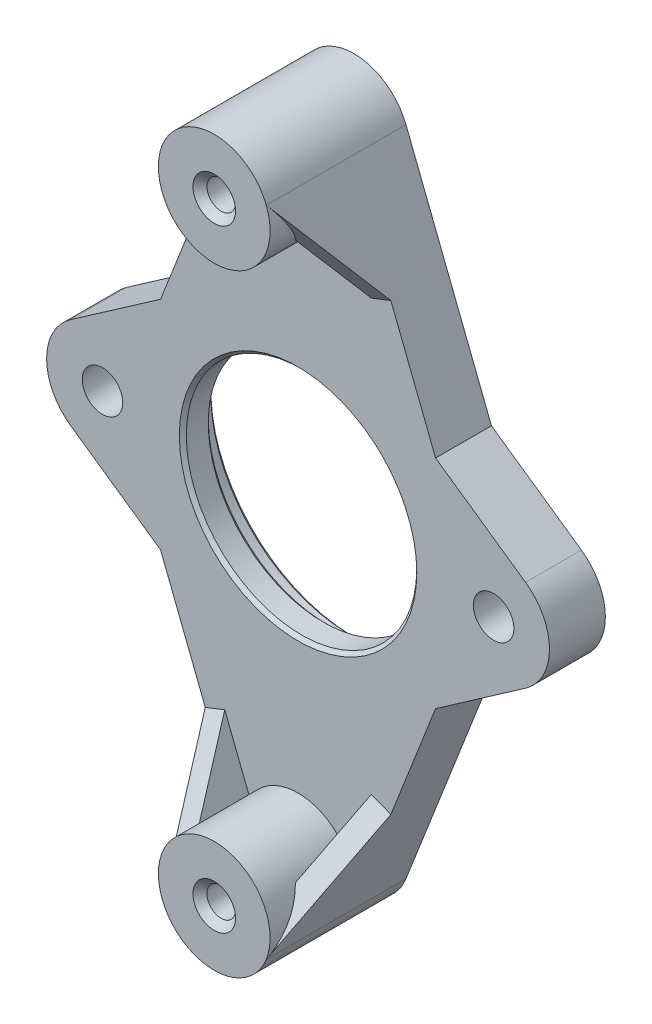
ISO-10303-21;
HEADER;
FILE_DESCRIPTION(('STEP AP214'),'2;1');
FILE_NAME('part.step','',(''),(''),'','','');
FILE_SCHEMA(('AUTOMOTIVE_DESIGN { 1 0 10303 214 1 1 1 1 }'));
ENDSEC;
DATA;
#1=APPLICATION_CONTEXT('core data for automotive mechanical design processes');
#2=APPLICATION_PROTOCOL_DEFINITION('international standard','automotive_design',2000,#1);
#3=PRODUCT_CONTEXT('',#1,'mechanical');
#4=PRODUCT('Part','Part','',(#3));
#5=PRODUCT_RELATED_PRODUCT_CATEGORY('part','',(#4));
#6=PRODUCT_DEFINITION_FORMATION('','',#4);
#7=PRODUCT_DEFINITION_CONTEXT('part definition',#1,'design');
#8=PRODUCT_DEFINITION('design','',#6,#7);
#9=PRODUCT_DEFINITION_SHAPE('','',#8);
#10=(LENGTH_UNIT() NAMED_UNIT(*) SI_UNIT(.MILLI.,.METRE.));
#11=(NAMED_UNIT(*) PLANE_ANGLE_UNIT() SI_UNIT($,.RADIAN.));
#12=(NAMED_UNIT(*) SI_UNIT($,.STERADIAN.) SOLID_ANGLE_UNIT());
#13=UNCERTAINTY_MEASURE_WITH_UNIT(LENGTH_MEASURE(1.E-05),#10,'distance_accuracy_value','');
#14=(GEOMETRIC_REPRESENTATION_CONTEXT(3) GLOBAL_UNCERTAINTY_ASSIGNED_CONTEXT((#13)) GLOBAL_UNIT_ASSIGNED_CONTEXT((#10,
#11,#12)) REPRESENTATION_CONTEXT('',''));
#15=CARTESIAN_POINT('',(0.,0.,0.));
#16=DIRECTION('',(0.,0.,1.));
#17=DIRECTION('',(1.,0.,0.));
#18=AXIS2_PLACEMENT_3D('',#15,#16,#17);
#19=CARTESIAN_POINT('',(0.,21.92,35.036562512032));
#20=DIRECTION('',(0.,0.,-1.));
#21=DIRECTION('',(-1.,0.,0.));
#22=AXIS2_PLACEMENT_3D('',#19,#20,#21);
#23=CYLINDRICAL_SURFACE('',#22,4.);
#24=CARTESIAN_POINT('',(0.,21.92,4.));
#25=DIRECTION('',(0.,0.,1.));
#26=DIRECTION('',(1.,0.,0.));
#27=AXIS2_PLACEMENT_3D('',#24,#25,#26);
#28=CIRCLE('',#27,4.);
#29=CARTESIAN_POINT('',(3.46715274058221,19.9252940383422,4.));
#30=VERTEX_POINT('',#29);
#31=CARTESIAN_POINT('',(-3.46715274058221,19.9252940383422,4.));
#32=VERTEX_POINT('',#31);
#33=EDGE_CURVE('E302',#30,#32,#28,.F.);
#34=ORIENTED_EDGE('',*,*,#33,.F.);
#35=DIRECTION('',(0.,0.,-1.));
#36=VECTOR('',#35,1.);
#37=CARTESIAN_POINT('',(3.46715274058221,19.9252940383422,35.036562512032));
#38=LINE('',#37,#36);
#39=CARTESIAN_POINT('',(3.46715274058221,19.9252940383422,7.6581257506006));
#40=VERTEX_POINT('',#39);
#41=EDGE_CURVE('E227',#30,#40,#38,.F.);
#42=ORIENTED_EDGE('',*,*,#41,.T.);
#43=CARTESIAN_POINT('',(0.,21.92,10.));
#44=DIRECTION('',(0.218978102189781,-0.558613095766079,0.8));
#45=DIRECTION('',(0.291970802919708,-0.744817461021437,-0.6));
#46=AXIS2_PLACEMENT_3D('',#43,#44,#45);
#47=ELLIPSE('',#46,5.,4.);
#48=CARTESIAN_POINT('',(3.72408730510719,23.3798540145985,10.));
#49=VERTEX_POINT('',#48);
#50=EDGE_CURVE('E219',#40,#49,#47,.T.);
#51=ORIENTED_EDGE('',*,*,#50,.T.);
#52=CARTESIAN_POINT('',(0.,21.92,10.));
#53=DIRECTION('',(0.,0.,1.));
#54=DIRECTION('',(1.,0.,0.));
#55=AXIS2_PLACEMENT_3D('',#52,#53,#54);
#56=CIRCLE('',#55,4.);
#57=CARTESIAN_POINT('',(-3.72408730510719,23.3798540145985,10.));
#58=VERTEX_POINT('',#57);
#59=EDGE_CURVE('E292',#58,#49,#56,.T.);
#60=ORIENTED_EDGE('',*,*,#59,.F.);
#61=CARTESIAN_POINT('',(0.,21.92,10.));
#62=DIRECTION('',(0.218978102189781,0.558613095766079,-0.8));
#63=DIRECTION('',(-0.291970802919708,-0.744817461021437,-0.6));
#64=AXIS2_PLACEMENT_3D('',#61,#62,#63);
#65=ELLIPSE('',#64,5.,4.);
#66=CARTESIAN_POINT('',(-3.46715274058221,19.9252940383422,7.6581257506006));
#67=VERTEX_POINT('',#66);
#68=EDGE_CURVE('E250',#67,#58,#65,.T.);
#69=ORIENTED_EDGE('',*,*,#68,.F.);
#70=DIRECTION('',(0.,0.,-1.));
#71=VECTOR('',#70,1.);
#72=CARTESIAN_POINT('',(-3.46715274058221,19.9252940383422,35.036562512032));
#73=LINE('',#72,#71);
#74=EDGE_CURVE('E247',#67,#32,#73,.T.);
#75=ORIENTED_EDGE('',*,*,#74,.T.);
#76=EDGE_LOOP('',(#34,#42,#51,#60,#69,#75));
#77=FACE_BOUND('',#76,.T.);
#78=ADVANCED_FACE('F75',(#77),#23,.T.);
#79=CARTESIAN_POINT('',(0.,0.,4.));
#80=DIRECTION('',(0.,0.,1.));
#81=DIRECTION('',(1.,0.,0.));
#82=AXIS2_PLACEMENT_3D('',#79,#80,#81);
#83=PLANE('',#82);
#84=DIRECTION('',(0.931021826276797,0.364963503649635,0.));
#85=VECTOR('',#84,1.);
#86=CARTESIAN_POINT('',(5.24726259488907,15.3842341489097,4.));
#87=LINE('',#86,#85);
#88=CARTESIAN_POINT('',(5.24726259488907,15.3842341489097,4.));
#89=VERTEX_POINT('',#88);
#90=CARTESIAN_POINT('',(6.64379533430427,15.9316794043842,4.));
#91=VERTEX_POINT('',#90);
#92=EDGE_CURVE('E216',#89,#91,#87,.T.);
#93=ORIENTED_EDGE('',*,*,#92,.F.);
#94=DIRECTION('',(-0.364963503649635,0.931021826276797,0.));
#95=VECTOR('',#94,1.);
#96=CARTESIAN_POINT('',(5.24726259488907,15.3842341489097,4.));
#97=LINE('',#96,#95);
#98=EDGE_CURVE('E222',#89,#30,#97,.T.);
#99=ORIENTED_EDGE('',*,*,#98,.T.);
#100=ORIENTED_EDGE('',*,*,#33,.T.);
#101=DIRECTION('',(0.364963503649635,0.931021826276797,0.));
#102=VECTOR('',#101,1.);
#103=CARTESIAN_POINT('',(-5.24726259488907,15.3842341489097,4.));
#104=LINE('',#103,#102);
#105=CARTESIAN_POINT('',(-5.24726259488907,15.3842341489097,4.));
#106=VERTEX_POINT('',#105);
#107=EDGE_CURVE('E91',#106,#32,#104,.T.);
#108=ORIENTED_EDGE('',*,*,#107,.F.);
#109=DIRECTION('',(-0.931021826276797,0.364963503649635,0.));
#110=VECTOR('',#109,1.);
#111=CARTESIAN_POINT('',(-5.24726259488907,15.3842341489097,4.));
#112=LINE('',#111,#110);
#113=CARTESIAN_POINT('',(-6.64379533430427,15.9316794043842,4.));
#114=VERTEX_POINT('',#113);
#115=EDGE_CURVE('E96',#106,#114,#112,.T.);
#116=ORIENTED_EDGE('',*,*,#115,.T.);
#117=DIRECTION('',(-0.364963503649635,-0.931021826276797,0.));
#118=VECTOR('',#117,1.);
#119=CARTESIAN_POINT('',(-11.1722619153216,4.37956204379562,4.));
#120=LINE('',#119,#118);
#121=CARTESIAN_POINT('',(-9.84395503832748,7.7680726266573,4.));
#122=VERTEX_POINT('',#121);
#123=EDGE_CURVE('E308',#114,#122,#120,.T.);
#124=ORIENTED_EDGE('',*,*,#123,.T.);
#125=DIRECTION('',(-0.82065180664829,-0.571428571428572,0.));
#126=VECTOR('',#125,1.);
#127=CARTESIAN_POINT('',(-6.85714285714286,9.84782167977948,4.));
#128=LINE('',#127,#126);
#129=CARTESIAN_POINT('',(-16.2857142857143,3.28260722659316,4.));
#130=VERTEX_POINT('',#129);
#131=EDGE_CURVE('E356',#122,#130,#128,.T.);
#132=ORIENTED_EDGE('',*,*,#131,.T.);
#133=CARTESIAN_POINT('',(-14.,0.,4.));
#134=DIRECTION('',(0.,0.,1.));
#135=DIRECTION('',(1.,0.,0.));
#136=AXIS2_PLACEMENT_3D('',#133,#134,#135);
#137=CIRCLE('',#136,4.);
#138=CARTESIAN_POINT('',(-16.2857142857143,-3.28260722659316,4.));
#139=VERTEX_POINT('',#138);
#140=EDGE_CURVE('E358',#130,#139,#137,.T.);
#141=ORIENTED_EDGE('',*,*,#140,.T.);
#142=DIRECTION('',(-0.82065180664829,0.571428571428572,0.));
#143=VECTOR('',#142,1.);
#144=CARTESIAN_POINT('',(-6.85714285714286,-9.84782167977948,4.));
#145=LINE('',#144,#143);
#146=CARTESIAN_POINT('',(-9.84395503832748,-7.7680726266573,4.));
#147=VERTEX_POINT('',#146);
#148=EDGE_CURVE('E362',#147,#139,#145,.T.);
#149=ORIENTED_EDGE('',*,*,#148,.F.);
#150=DIRECTION('',(-0.364963503649635,0.931021826276797,0.));
#151=VECTOR('',#150,1.);
#152=CARTESIAN_POINT('',(-11.1722619153216,-4.37956204379562,4.));
#153=LINE('',#152,#151);
#154=CARTESIAN_POINT('',(-6.64379533430427,-15.9316794043842,4.));
#155=VERTEX_POINT('',#154);
#156=EDGE_CURVE('E320',#155,#147,#153,.T.);
#157=ORIENTED_EDGE('',*,*,#156,.F.);
#158=DIRECTION('',(-0.931021826276797,-0.364963503649635,0.));
#159=VECTOR('',#158,1.);
#160=CARTESIAN_POINT('',(-5.24726259488907,-15.3842341489097,4.));
#161=LINE('',#160,#159);
#162=CARTESIAN_POINT('',(-5.24726259488907,-15.3842341489097,4.));
#163=VERTEX_POINT('',#162);
#164=EDGE_CURVE('E275',#163,#155,#161,.T.);
#165=ORIENTED_EDGE('',*,*,#164,.F.);
#166=DIRECTION('',(0.364963503649635,-0.931021826276797,0.));
#167=VECTOR('',#166,1.);
#168=CARTESIAN_POINT('',(-5.24726259488907,-15.3842341489097,4.));
#169=LINE('',#168,#167);
#170=CARTESIAN_POINT('',(-3.46715274058221,-19.9252940383422,4.));
#171=VERTEX_POINT('',#170);
#172=EDGE_CURVE('E272',#163,#171,#169,.T.);
#173=ORIENTED_EDGE('',*,*,#172,.T.);
#174=CARTESIAN_POINT('',(0.,-21.92,4.));
#175=DIRECTION('',(0.,0.,1.));
#176=DIRECTION('',(1.,0.,0.));
#177=AXIS2_PLACEMENT_3D('',#174,#175,#176);
#178=CIRCLE('',#177,4.);
#179=CARTESIAN_POINT('',(3.46715274058221,-19.9252940383422,4.));
#180=VERTEX_POINT('',#179);
#181=EDGE_CURVE('E295',#171,#180,#178,.F.);
#182=ORIENTED_EDGE('',*,*,#181,.T.);
#183=DIRECTION('',(-0.364963503649635,-0.931021826276797,0.));
#184=VECTOR('',#183,1.);
#185=CARTESIAN_POINT('',(5.24726259488907,-15.3842341489097,4.));
#186=LINE('',#185,#184);
#187=CARTESIAN_POINT('',(5.24726259488907,-15.3842341489097,4.));
#188=VERTEX_POINT('',#187);
#189=EDGE_CURVE('E254',#188,#180,#186,.T.);
#190=ORIENTED_EDGE('',*,*,#189,.F.);
#191=DIRECTION('',(0.931021826276797,-0.364963503649635,0.));
#192=VECTOR('',#191,1.);
#193=CARTESIAN_POINT('',(5.24726259488907,-15.3842341489097,4.));
#194=LINE('',#193,#192);
#195=CARTESIAN_POINT('',(6.64379533430427,-15.9316794043842,4.));
#196=VERTEX_POINT('',#195);
#197=EDGE_CURVE('E260',#188,#196,#194,.T.);
#198=ORIENTED_EDGE('',*,*,#197,.T.);
#199=DIRECTION('',(0.364963503649635,0.931021826276797,0.));
#200=VECTOR('',#199,1.);
#201=CARTESIAN_POINT('',(11.1722619153216,-4.37956204379562,4.));
#202=LINE('',#201,#200);
#203=CARTESIAN_POINT('',(9.84395503832748,-7.7680726266573,4.));
#204=VERTEX_POINT('',#203);
#205=EDGE_CURVE('E304',#196,#204,#202,.T.);
#206=ORIENTED_EDGE('',*,*,#205,.T.);
#207=DIRECTION('',(0.820651806648289,0.571428571428572,0.));
#208=VECTOR('',#207,1.);
#209=CARTESIAN_POINT('',(6.85714285714287,-9.84782167977947,4.));
#210=LINE('',#209,#208);
#211=CARTESIAN_POINT('',(16.2857142857143,-3.28260722659315,4.));
#212=VERTEX_POINT('',#211);
#213=EDGE_CURVE('E378',#204,#212,#210,.T.);
#214=ORIENTED_EDGE('',*,*,#213,.T.);
#215=CARTESIAN_POINT('',(14.,0.,4.));
#216=DIRECTION('',(0.,0.,1.));
#217=DIRECTION('',(1.,0.,0.));
#218=AXIS2_PLACEMENT_3D('',#215,#216,#217);
#219=CIRCLE('',#218,4.);
#220=CARTESIAN_POINT('',(16.2857142857143,3.28260722659316,4.));
#221=VERTEX_POINT('',#220);
#222=EDGE_CURVE('E380',#212,#221,#219,.T.);
#223=ORIENTED_EDGE('',*,*,#222,.T.);
#224=DIRECTION('',(0.82065180664829,-0.571428571428571,0.));
#225=VECTOR('',#224,1.);
#226=CARTESIAN_POINT('',(6.85714285714286,9.84782167977948,4.));
#227=LINE('',#226,#225);
#228=CARTESIAN_POINT('',(9.84395503832748,7.7680726266573,4.));
#229=VERTEX_POINT('',#228);
#230=EDGE_CURVE('E384',#229,#221,#227,.T.);
#231=ORIENTED_EDGE('',*,*,#230,.F.);
#232=DIRECTION('',(0.364963503649635,-0.931021826276797,0.));
#233=VECTOR('',#232,1.);
#234=CARTESIAN_POINT('',(11.1722619153216,4.37956204379563,4.));
#235=LINE('',#234,#233);
#236=EDGE_CURVE('E234',#91,#229,#235,.T.);
#237=ORIENTED_EDGE('',*,*,#236,.F.);
#238=EDGE_LOOP('',(#93,#99,#100,#108,#116,#124,#132,#141,#149,#157,#165,#173,#182,#190,#198,
#206,#214,#223,#231,#237));
#239=FACE_BOUND('',#238,.T.);
#240=CARTESIAN_POINT('',(0.,0.,4.));
#241=DIRECTION('',(0.,0.,1.));
#242=DIRECTION('',(1.,0.,0.));
#243=AXIS2_PLACEMENT_3D('',#240,#241,#242);
#244=CIRCLE('',#243,8.50000000000002);
#245=CARTESIAN_POINT('',(8.50000000000002,0.,4.));
#246=VERTEX_POINT('',#245);
#247=EDGE_CURVE('E401',#246,#246,#244,.F.);
#248=ORIENTED_EDGE('',*,*,#247,.T.);
#249=EDGE_LOOP('',(#248));
#250=FACE_BOUND('',#249,.T.);
#251=CARTESIAN_POINT('',(-14.,0.,4.));
#252=DIRECTION('',(0.,0.,1.));
#253=DIRECTION('',(1.,0.,0.));
#254=AXIS2_PLACEMENT_3D('',#251,#252,#253);
#255=CIRCLE('',#254,1.45);
#256=CARTESIAN_POINT('',(-12.55,0.,4.));
#257=VERTEX_POINT('',#256);
#258=EDGE_CURVE('E343',#257,#257,#255,.T.);
#259=ORIENTED_EDGE('',*,*,#258,.F.);
#260=EDGE_LOOP('',(#259));
#261=FACE_BOUND('',#260,.T.);
#262=CARTESIAN_POINT('',(14.,0.,4.));
#263=DIRECTION('',(0.,0.,1.));
#264=DIRECTION('',(1.,0.,0.));
#265=AXIS2_PLACEMENT_3D('',#262,#263,#264);
#266=CIRCLE('',#265,1.45);
#267=CARTESIAN_POINT('',(15.45,0.,4.));
#268=VERTEX_POINT('',#267);
#269=EDGE_CURVE('E349',#268,#268,#266,.T.);
#270=ORIENTED_EDGE('',*,*,#269,.F.);
#271=EDGE_LOOP('',(#270));
#272=FACE_BOUND('',#271,.T.);
#273=ADVANCED_FACE('F231',(#239,#250,#261,#272),#83,.T.);
#274=CARTESIAN_POINT('',(0.,-21.92,35.036562512032));
#275=DIRECTION('',(0.,0.,-1.));
#276=DIRECTION('',(-1.,0.,0.));
#277=AXIS2_PLACEMENT_3D('',#274,#275,#276);
#278=CYLINDRICAL_SURFACE('',#277,4.);
#279=DIRECTION('',(0.,0.,-1.));
#280=VECTOR('',#279,1.);
#281=CARTESIAN_POINT('',(3.72408730510719,-23.3798540145985,35.036562512032));
#282=LINE('',#281,#280);
#283=CARTESIAN_POINT('',(3.72408730510719,-23.3798540145985,10.));
#284=VERTEX_POINT('',#283);
#285=CARTESIAN_POINT('',(3.72408730510719,-23.3798540145985,0.));
#286=VERTEX_POINT('',#285);
#287=EDGE_CURVE('E327',#284,#286,#282,.T.);
#288=ORIENTED_EDGE('',*,*,#287,.F.);
#289=CARTESIAN_POINT('',(0.,-21.92,10.));
#290=DIRECTION('',(0.,0.,1.));
#291=DIRECTION('',(1.,0.,0.));
#292=AXIS2_PLACEMENT_3D('',#289,#290,#291);
#293=CIRCLE('',#292,4.);
#294=CARTESIAN_POINT('',(-3.72408730510719,-23.3798540145985,10.));
#295=VERTEX_POINT('',#294);
#296=EDGE_CURVE('E297',#295,#284,#293,.T.);
#297=ORIENTED_EDGE('',*,*,#296,.F.);
#298=DIRECTION('',(0.,0.,-1.));
#299=VECTOR('',#298,1.);
#300=CARTESIAN_POINT('',(-3.72408730510719,-23.3798540145985,35.036562512032));
#301=LINE('',#300,#299);
#302=CARTESIAN_POINT('',(-3.72408730510719,-23.3798540145985,0.));
#303=VERTEX_POINT('',#302);
#304=EDGE_CURVE('E326',#295,#303,#301,.T.);
#305=ORIENTED_EDGE('',*,*,#304,.T.);
#306=CARTESIAN_POINT('',(0.,-21.92,0.));
#307=DIRECTION('',(0.,0.,1.));
#308=DIRECTION('',(1.,0.,0.));
#309=AXIS2_PLACEMENT_3D('',#306,#307,#308);
#310=CIRCLE('',#309,4.);
#311=EDGE_CURVE('E328',#303,#286,#310,.T.);
#312=ORIENTED_EDGE('',*,*,#311,.T.);
#313=EDGE_LOOP('',(#288,#297,#305,#312));
#314=FACE_BOUND('',#313,.T.);
#315=ADVANCED_FACE('F452',(#314),#278,.T.);
#316=CARTESIAN_POINT('',(-6.85714285714286,9.84782167977948,4.));
#317=DIRECTION('',(0.571428571428572,-0.82065180664829,0.));
#318=DIRECTION('',(0.82065180664829,0.571428571428572,0.));
#319=AXIS2_PLACEMENT_3D('',#316,#317,#318);
#320=PLANE('',#319);
#321=DIRECTION('',(0.,0.,1.));
#322=VECTOR('',#321,1.);
#323=CARTESIAN_POINT('',(-9.84395503832748,7.7680726266573,4.));
#324=LINE('',#323,#322);
#325=CARTESIAN_POINT('',(-9.84395503832748,7.7680726266573,0.));
#326=VERTEX_POINT('',#325);
#327=EDGE_CURVE('E340',#326,#122,#324,.T.);
#328=ORIENTED_EDGE('',*,*,#327,.F.);
#329=DIRECTION('',(-0.82065180664829,-0.571428571428572,0.));
#330=VECTOR('',#329,1.);
#331=CARTESIAN_POINT('',(-6.85714285714286,9.84782167977948,0.));
#332=LINE('',#331,#330);
#333=CARTESIAN_POINT('',(-16.2857142857143,3.28260722659316,0.));
#334=VERTEX_POINT('',#333);
#335=EDGE_CURVE('E365',#326,#334,#332,.T.);
#336=ORIENTED_EDGE('',*,*,#335,.T.);
#337=DIRECTION('',(0.,0.,-1.));
#338=VECTOR('',#337,1.);
#339=CARTESIAN_POINT('',(-16.2857142857143,3.28260722659316,4.));
#340=LINE('',#339,#338);
#341=EDGE_CURVE('E374',#130,#334,#340,.T.);
#342=ORIENTED_EDGE('',*,*,#341,.F.);
#343=ORIENTED_EDGE('',*,*,#131,.F.);
#344=EDGE_LOOP('',(#328,#336,#342,#343));
#345=FACE_BOUND('',#344,.T.);
#346=ADVANCED_FACE('F488',(#345),#320,.F.);
#347=CARTESIAN_POINT('',(6.85714285714287,-9.84782167977947,4.));
#348=DIRECTION('',(-0.571428571428572,0.820651806648289,0.));
#349=DIRECTION('',(-0.820651806648289,-0.571428571428572,0.));
#350=AXIS2_PLACEMENT_3D('',#347,#348,#349);
#351=PLANE('',#350);
#352=DIRECTION('',(0.,0.,1.));
#353=VECTOR('',#352,1.);
#354=CARTESIAN_POINT('',(9.84395503832748,-7.7680726266573,4.));
#355=LINE('',#354,#353);
#356=CARTESIAN_POINT('',(9.84395503832748,-7.7680726266573,0.));
#357=VERTEX_POINT('',#356);
#358=EDGE_CURVE('E419',#357,#204,#355,.T.);
#359=ORIENTED_EDGE('',*,*,#358,.F.);
#360=DIRECTION('',(0.820651806648289,0.571428571428572,0.));
#361=VECTOR('',#360,1.);
#362=CARTESIAN_POINT('',(6.85714285714287,-9.84782167977947,0.));
#363=LINE('',#362,#361);
#364=CARTESIAN_POINT('',(16.2857142857143,-3.28260722659315,0.));
#365=VERTEX_POINT('',#364);
#366=EDGE_CURVE('E355',#357,#365,#363,.T.);
#367=ORIENTED_EDGE('',*,*,#366,.T.);
#368=DIRECTION('',(0.,0.,-1.));
#369=VECTOR('',#368,1.);
#370=CARTESIAN_POINT('',(16.2857142857143,-3.28260722659315,4.));
#371=LINE('',#370,#369);
#372=EDGE_CURVE('E368',#212,#365,#371,.T.);
#373=ORIENTED_EDGE('',*,*,#372,.F.);
#374=ORIENTED_EDGE('',*,*,#213,.F.);
#375=EDGE_LOOP('',(#359,#367,#373,#374));
#376=FACE_BOUND('',#375,.T.);
#377=ADVANCED_FACE('F533',(#376),#351,.F.);
#378=CARTESIAN_POINT('',(-14.,0.,4.));
#379=DIRECTION('',(0.,0.,-1.));
#380=DIRECTION('',(-1.,0.,0.));
#381=AXIS2_PLACEMENT_3D('',#378,#379,#380);
#382=CYLINDRICAL_SURFACE('',#381,4.);
#383=CARTESIAN_POINT('',(-14.,0.,0.));
#384=DIRECTION('',(0.,0.,1.));
#385=DIRECTION('',(1.,0.,0.));
#386=AXIS2_PLACEMENT_3D('',#383,#384,#385);
#387=CIRCLE('',#386,4.);
#388=CARTESIAN_POINT('',(-16.2857142857143,-3.28260722659316,0.));
#389=VERTEX_POINT('',#388);
#390=EDGE_CURVE('E367',#334,#389,#387,.T.);
#391=ORIENTED_EDGE('',*,*,#390,.T.);
#392=DIRECTION('',(0.,0.,-1.));
#393=VECTOR('',#392,1.);
#394=CARTESIAN_POINT('',(-16.2857142857143,-3.28260722659316,4.));
#395=LINE('',#394,#393);
#396=EDGE_CURVE('E364',#139,#389,#395,.T.);
#397=ORIENTED_EDGE('',*,*,#396,.F.);
#398=ORIENTED_EDGE('',*,*,#140,.F.);
#399=ORIENTED_EDGE('',*,*,#341,.T.);
#400=EDGE_LOOP('',(#391,#397,#398,#399));
#401=FACE_BOUND('',#400,.T.);
#402=ADVANCED_FACE('F492',(#401),#382,.T.);
#403=CARTESIAN_POINT('',(-6.85714285714286,-9.84782167977948,4.));
#404=DIRECTION('',(-0.571428571428572,-0.82065180664829,0.));
#405=DIRECTION('',(0.82065180664829,-0.571428571428572,0.));
#406=AXIS2_PLACEMENT_3D('',#403,#404,#405);
#407=PLANE('',#406);
#408=DIRECTION('',(0.,0.,-1.));
#409=VECTOR('',#408,1.);
#410=CARTESIAN_POINT('',(-9.84395503832748,-7.76807262665731,4.));
#411=LINE('',#410,#409);
#412=CARTESIAN_POINT('',(-9.84395503832748,-7.7680726266573,0.));
#413=VERTEX_POINT('',#412);
#414=EDGE_CURVE('E317',#147,#413,#411,.T.);
#415=ORIENTED_EDGE('',*,*,#414,.F.);
#416=ORIENTED_EDGE('',*,*,#148,.T.);
#417=ORIENTED_EDGE('',*,*,#396,.T.);
#418=DIRECTION('',(-0.82065180664829,0.571428571428572,0.));
#419=VECTOR('',#418,1.);
#420=CARTESIAN_POINT('',(-6.85714285714286,-9.84782167977948,0.));
#421=LINE('',#420,#419);
#422=EDGE_CURVE('E359',#413,#389,#421,.T.);
#423=ORIENTED_EDGE('',*,*,#422,.F.);
#424=EDGE_LOOP('',(#415,#416,#417,#423));
#425=FACE_BOUND('',#424,.T.);
#426=ADVANCED_FACE('F499',(#425),#407,.T.);
#427=CARTESIAN_POINT('',(0.,0.,0.));
#428=DIRECTION('',(0.,0.,1.));
#429=DIRECTION('',(1.,0.,0.));
#430=AXIS2_PLACEMENT_3D('',#427,#428,#429);
#431=PLANE('',#430);
#432=CARTESIAN_POINT('',(0.,21.92,0.));
#433=DIRECTION('',(0.,0.,1.));
#434=DIRECTION('',(1.,0.,0.));
#435=AXIS2_PLACEMENT_3D('',#432,#433,#434);
#436=CIRCLE('',#435,1.025);
#437=CARTESIAN_POINT('',(1.025,21.92,0.));
#438=VERTEX_POINT('',#437);
#439=EDGE_CURVE('E285',#438,#438,#436,.T.);
#440=ORIENTED_EDGE('',*,*,#439,.T.);
#441=EDGE_LOOP('',(#440));
#442=FACE_BOUND('',#441,.T.);
#443=CARTESIAN_POINT('',(0.,-21.92,0.));
#444=DIRECTION('',(0.,0.,1.));
#445=DIRECTION('',(1.,0.,0.));
#446=AXIS2_PLACEMENT_3D('',#443,#444,#445);
#447=CIRCLE('',#446,1.025);
#448=CARTESIAN_POINT('',(1.025,-21.92,0.));
#449=VERTEX_POINT('',#448);
#450=EDGE_CURVE('E288',#449,#449,#447,.T.);
#451=ORIENTED_EDGE('',*,*,#450,.T.);
#452=EDGE_LOOP('',(#451));
#453=FACE_BOUND('',#452,.T.);
#454=DIRECTION('',(-0.364963503649635,-0.931021826276797,0.));
#455=VECTOR('',#454,1.);
#456=CARTESIAN_POINT('',(-11.1722619153216,4.37956204379562,0.));
#457=LINE('',#456,#455);
#458=CARTESIAN_POINT('',(-3.72408730510719,23.3798540145985,0.));
#459=VERTEX_POINT('',#458);
#460=EDGE_CURVE('E309',#459,#326,#457,.T.);
#461=ORIENTED_EDGE('',*,*,#460,.F.);
#462=CARTESIAN_POINT('',(0.,21.92,0.));
#463=DIRECTION('',(0.,0.,1.));
#464=DIRECTION('',(1.,0.,0.));
#465=AXIS2_PLACEMENT_3D('',#462,#463,#464);
#466=CIRCLE('',#465,4.);
#467=CARTESIAN_POINT('',(3.72408730510719,23.3798540145985,0.));
#468=VERTEX_POINT('',#467);
#469=EDGE_CURVE('E314',#468,#459,#466,.T.);
#470=ORIENTED_EDGE('',*,*,#469,.F.);
#471=DIRECTION('',(0.364963503649635,-0.931021826276797,0.));
#472=VECTOR('',#471,1.);
#473=CARTESIAN_POINT('',(11.1722619153216,4.37956204379563,0.));
#474=LINE('',#473,#472);
#475=CARTESIAN_POINT('',(9.84395503832748,7.7680726266573,0.));
#476=VERTEX_POINT('',#475);
#477=EDGE_CURVE('E305',#468,#476,#474,.T.);
#478=ORIENTED_EDGE('',*,*,#477,.T.);
#479=DIRECTION('',(0.82065180664829,-0.571428571428571,0.));
#480=VECTOR('',#479,1.);
#481=CARTESIAN_POINT('',(6.85714285714286,9.84782167977948,0.));
#482=LINE('',#481,#480);
#483=CARTESIAN_POINT('',(16.2857142857143,3.28260722659316,0.));
#484=VERTEX_POINT('',#483);
#485=EDGE_CURVE('E381',#476,#484,#482,.T.);
#486=ORIENTED_EDGE('',*,*,#485,.T.);
#487=CARTESIAN_POINT('',(14.,0.,0.));
#488=DIRECTION('',(0.,0.,1.));
#489=DIRECTION('',(1.,0.,0.));
#490=AXIS2_PLACEMENT_3D('',#487,#488,#489);
#491=CIRCLE('',#490,4.);
#492=EDGE_CURVE('E388',#365,#484,#491,.T.);
#493=ORIENTED_EDGE('',*,*,#492,.F.);
#494=ORIENTED_EDGE('',*,*,#366,.F.);
#495=DIRECTION('',(0.364963503649635,0.931021826276797,0.));
#496=VECTOR('',#495,1.);
#497=CARTESIAN_POINT('',(11.1722619153216,-4.37956204379562,0.));
#498=LINE('',#497,#496);
#499=EDGE_CURVE('E323',#286,#357,#498,.T.);
#500=ORIENTED_EDGE('',*,*,#499,.F.);
#501=ORIENTED_EDGE('',*,*,#311,.F.);
#502=DIRECTION('',(-0.364963503649635,0.931021826276797,0.));
#503=VECTOR('',#502,1.);
#504=CARTESIAN_POINT('',(-11.1722619153216,-4.37956204379562,0.));
#505=LINE('',#504,#503);
#506=EDGE_CURVE('E331',#303,#413,#505,.T.);
#507=ORIENTED_EDGE('',*,*,#506,.T.);
#508=ORIENTED_EDGE('',*,*,#422,.T.);
#509=ORIENTED_EDGE('',*,*,#390,.F.);
#510=ORIENTED_EDGE('',*,*,#335,.F.);
#511=EDGE_LOOP('',(#461,#470,#478,#486,#493,#494,#500,#501,#507,#508,#509,#510));
#512=FACE_BOUND('',#511,.T.);
#513=CARTESIAN_POINT('',(0.,0.,0.));
#514=DIRECTION('',(0.,0.,1.));
#515=DIRECTION('',(1.,0.,0.));
#516=AXIS2_PLACEMENT_3D('',#513,#514,#515);
#517=CIRCLE('',#516,10.25);
#518=CARTESIAN_POINT('',(10.25,0.,0.));
#519=VERTEX_POINT('',#518);
#520=EDGE_CURVE('E410',#519,#519,#517,.T.);
#521=ORIENTED_EDGE('',*,*,#520,.T.);
#522=EDGE_LOOP('',(#521));
#523=FACE_BOUND('',#522,.T.);
#524=CARTESIAN_POINT('',(-14.,0.,0.));
#525=DIRECTION('',(0.,0.,1.));
#526=DIRECTION('',(1.,0.,0.));
#527=AXIS2_PLACEMENT_3D('',#524,#525,#526);
#528=CIRCLE('',#527,1.45);
#529=CARTESIAN_POINT('',(-12.55,0.,0.));
#530=VERTEX_POINT('',#529);
#531=EDGE_CURVE('E346',#530,#530,#528,.T.);
#532=ORIENTED_EDGE('',*,*,#531,.T.);
#533=EDGE_LOOP('',(#532));
#534=FACE_BOUND('',#533,.T.);
#535=CARTESIAN_POINT('',(14.,0.,0.));
#536=DIRECTION('',(0.,0.,1.));
#537=DIRECTION('',(1.,0.,0.));
#538=AXIS2_PLACEMENT_3D('',#535,#536,#537);
#539=CIRCLE('',#538,1.45);
#540=CARTESIAN_POINT('',(15.45,0.,0.));
#541=VERTEX_POINT('',#540);
#542=EDGE_CURVE('E352',#541,#541,#539,.T.);
#543=ORIENTED_EDGE('',*,*,#542,.T.);
#544=EDGE_LOOP('',(#543));
#545=FACE_BOUND('',#544,.T.);
#546=ADVANCED_FACE('F506',(#442,#453,#512,#523,#534,#545),#431,.F.);
#547=CARTESIAN_POINT('',(14.,0.,4.));
#548=DIRECTION('',(0.,0.,-1.));
#549=DIRECTION('',(-1.,0.,0.));
#550=AXIS2_PLACEMENT_3D('',#547,#548,#549);
#551=CYLINDRICAL_SURFACE('',#550,4.);
#552=ORIENTED_EDGE('',*,*,#492,.T.);
#553=DIRECTION('',(0.,0.,-1.));
#554=VECTOR('',#553,1.);
#555=CARTESIAN_POINT('',(16.2857142857143,3.28260722659316,4.));
#556=LINE('',#555,#554);
#557=EDGE_CURVE('E386',#221,#484,#556,.T.);
#558=ORIENTED_EDGE('',*,*,#557,.F.);
#559=ORIENTED_EDGE('',*,*,#222,.F.);
#560=ORIENTED_EDGE('',*,*,#372,.T.);
#561=EDGE_LOOP('',(#552,#558,#559,#560));
#562=FACE_BOUND('',#561,.T.);
#563=ADVANCED_FACE('F538',(#562),#551,.T.);
#564=CARTESIAN_POINT('',(6.85714285714286,9.84782167977948,4.));
#565=DIRECTION('',(0.571428571428571,0.82065180664829,0.));
#566=DIRECTION('',(-0.82065180664829,0.571428571428571,0.));
#567=AXIS2_PLACEMENT_3D('',#564,#565,#566);
#568=PLANE('',#567);
#569=DIRECTION('',(0.,0.,-1.));
#570=VECTOR('',#569,1.);
#571=CARTESIAN_POINT('',(9.84395503832748,7.7680726266573,4.));
#572=LINE('',#571,#570);
#573=EDGE_CURVE('E422',#229,#476,#572,.T.);
#574=ORIENTED_EDGE('',*,*,#573,.F.);
#575=ORIENTED_EDGE('',*,*,#230,.T.);
#576=ORIENTED_EDGE('',*,*,#557,.T.);
#577=ORIENTED_EDGE('',*,*,#485,.F.);
#578=EDGE_LOOP('',(#574,#575,#576,#577));
#579=FACE_BOUND('',#578,.T.);
#580=ADVANCED_FACE('F542',(#579),#568,.T.);
#581=CARTESIAN_POINT('',(0.,0.,-1.2E-05));
#582=DIRECTION('',(0.,0.,1.));
#583=DIRECTION('',(1.,0.,0.));
#584=AXIS2_PLACEMENT_3D('',#581,#582,#583);
#585=CYLINDRICAL_SURFACE('',#584,8.25);
#586=CARTESIAN_POINT('',(0.,0.,3.74999999999999));
#587=DIRECTION('',(0.,0.,1.));
#588=DIRECTION('',(1.,0.,0.));
#589=AXIS2_PLACEMENT_3D('',#586,#587,#588);
#590=CIRCLE('',#589,8.25);
#591=CARTESIAN_POINT('',(8.25,0.,3.74999999999999));
#592=VERTEX_POINT('',#591);
#593=EDGE_CURVE('E398',#592,#592,#590,.T.);
#594=ORIENTED_EDGE('',*,*,#593,.T.);
#595=EDGE_LOOP('',(#594));
#596=FACE_BOUND('',#595,.T.);
#597=CARTESIAN_POINT('',(0.,0.,2.18000000000002));
#598=DIRECTION('',(0.,0.,1.));
#599=DIRECTION('',(1.,0.,0.));
#600=AXIS2_PLACEMENT_3D('',#597,#598,#599);
#601=CIRCLE('',#600,8.25);
#602=CARTESIAN_POINT('',(8.25,0.,2.18000000000002));
#603=VERTEX_POINT('',#602);
#604=EDGE_CURVE('E377',#603,#603,#601,.F.);
#605=ORIENTED_EDGE('',*,*,#604,.T.);
#606=EDGE_LOOP('',(#605));
#607=FACE_BOUND('',#606,.T.);
#608=ADVANCED_FACE('F545',(#596,#607),#585,.F.);
#609=CARTESIAN_POINT('',(0.,0.,-1.2E-05));
#610=DIRECTION('',(0.,0.,1.));
#611=DIRECTION('',(1.,0.,0.));
#612=AXIS2_PLACEMENT_3D('',#609,#610,#611);
#613=CYLINDRICAL_SURFACE('',#612,10.);
#614=CARTESIAN_POINT('',(0.,0.,0.249999999999983));
#615=DIRECTION('',(0.,0.,1.));
#616=DIRECTION('',(1.,0.,0.));
#617=AXIS2_PLACEMENT_3D('',#614,#615,#616);
#618=CIRCLE('',#617,10.);
#619=CARTESIAN_POINT('',(10.,0.,0.249999999999983));
#620=VERTEX_POINT('',#619);
#621=EDGE_CURVE('E416',#620,#620,#618,.F.);
#622=ORIENTED_EDGE('',*,*,#621,.T.);
#623=EDGE_LOOP('',(#622));
#624=FACE_BOUND('',#623,.T.);
#625=CARTESIAN_POINT('',(0.,0.,1.67999999999999));
#626=DIRECTION('',(0.,0.,1.));
#627=DIRECTION('',(1.,0.,0.));
#628=AXIS2_PLACEMENT_3D('',#625,#626,#627);
#629=CIRCLE('',#628,10.);
#630=CARTESIAN_POINT('',(10.,0.,1.67999999999999));
#631=VERTEX_POINT('',#630);
#632=EDGE_CURVE('E413',#631,#631,#629,.T.);
#633=ORIENTED_EDGE('',*,*,#632,.T.);
#634=EDGE_LOOP('',(#633));
#635=FACE_BOUND('',#634,.T.);
#636=ADVANCED_FACE('F552',(#624,#635),#613,.F.);
#637=CARTESIAN_POINT('',(0.,0.,1.93));
#638=DIRECTION('',(0.,0.,1.));
#639=DIRECTION('',(1.,0.,0.));
#640=AXIS2_PLACEMENT_3D('',#637,#638,#639);
#641=PLANE('',#640);
#642=CARTESIAN_POINT('',(0.,0.,1.93));
#643=DIRECTION('',(0.,0.,1.));
#644=DIRECTION('',(1.,0.,0.));
#645=AXIS2_PLACEMENT_3D('',#642,#643,#644);
#646=CIRCLE('',#645,8.50000000000002);
#647=CARTESIAN_POINT('',(8.50000000000002,0.,1.93));
#648=VERTEX_POINT('',#647);
#649=EDGE_CURVE('E407',#648,#648,#646,.T.);
#650=ORIENTED_EDGE('',*,*,#649,.T.);
#651=EDGE_LOOP('',(#650));
#652=FACE_BOUND('',#651,.T.);
#653=CARTESIAN_POINT('',(0.,0.,1.93));
#654=DIRECTION('',(0.,0.,1.));
#655=DIRECTION('',(1.,0.,0.));
#656=AXIS2_PLACEMENT_3D('',#653,#654,#655);
#657=CIRCLE('',#656,9.74999999999999);
#658=CARTESIAN_POINT('',(9.74999999999999,0.,1.93));
#659=VERTEX_POINT('',#658);
#660=EDGE_CURVE('E404',#659,#659,#657,.F.);
#661=ORIENTED_EDGE('',*,*,#660,.T.);
#662=EDGE_LOOP('',(#661));
#663=FACE_BOUND('',#662,.T.);
#664=ADVANCED_FACE('F604',(#652,#663),#641,.F.);
#665=CARTESIAN_POINT('',(14.,0.,4.));
#666=DIRECTION('',(0.,0.,1.));
#667=DIRECTION('',(1.,0.,0.));
#668=AXIS2_PLACEMENT_3D('',#665,#666,#667);
#669=CYLINDRICAL_SURFACE('',#668,1.45);
#670=ORIENTED_EDGE('',*,*,#542,.F.);
#671=EDGE_LOOP('',(#670));
#672=FACE_BOUND('',#671,.T.);
#673=ORIENTED_EDGE('',*,*,#269,.T.);
#674=EDGE_LOOP('',(#673));
#675=FACE_BOUND('',#674,.T.);
#676=ADVANCED_FACE('F610',(#672,#675),#669,.F.);
#677=CARTESIAN_POINT('',(-14.,0.,4.));
#678=DIRECTION('',(0.,0.,1.));
#679=DIRECTION('',(1.,0.,0.));
#680=AXIS2_PLACEMENT_3D('',#677,#678,#679);
#681=CYLINDRICAL_SURFACE('',#680,1.45);
#682=ORIENTED_EDGE('',*,*,#531,.F.);
#683=EDGE_LOOP('',(#682));
#684=FACE_BOUND('',#683,.T.);
#685=ORIENTED_EDGE('',*,*,#258,.T.);
#686=EDGE_LOOP('',(#685));
#687=FACE_BOUND('',#686,.T.);
#688=ADVANCED_FACE('F570',(#684,#687),#681,.F.);
#689=CARTESIAN_POINT('',(0.,0.,3.74999999999999));
#690=DIRECTION('',(0.,0.,1.));
#691=DIRECTION('',(1.,0.,0.));
#692=AXIS2_PLACEMENT_3D('',#689,#690,#691);
#693=CONICAL_SURFACE('',#692,8.25,0.785398163397459);
#694=ORIENTED_EDGE('',*,*,#247,.F.);
#695=EDGE_LOOP('',(#694));
#696=FACE_BOUND('',#695,.T.);
#697=ORIENTED_EDGE('',*,*,#593,.F.);
#698=EDGE_LOOP('',(#697));
#699=FACE_BOUND('',#698,.T.);
#700=ADVANCED_FACE('F563',(#696,#699),#693,.F.);
#701=CARTESIAN_POINT('',(0.,0.,2.18000000000002));
#702=DIRECTION('',(0.,0.,-1.));
#703=DIRECTION('',(-1.,0.,0.));
#704=AXIS2_PLACEMENT_3D('',#701,#702,#703);
#705=CONICAL_SURFACE('',#704,8.25,0.785398163397445);
#706=ORIENTED_EDGE('',*,*,#649,.F.);
#707=EDGE_LOOP('',(#706));
#708=FACE_BOUND('',#707,.T.);
#709=ORIENTED_EDGE('',*,*,#604,.F.);
#710=EDGE_LOOP('',(#709));
#711=FACE_BOUND('',#710,.T.);
#712=ADVANCED_FACE('F569',(#708,#711),#705,.F.);
#713=CARTESIAN_POINT('',(0.,0.,0.));
#714=DIRECTION('',(0.,0.,-1.));
#715=DIRECTION('',(-1.,0.,0.));
#716=AXIS2_PLACEMENT_3D('',#713,#714,#715);
#717=CONICAL_SURFACE('',#716,10.25,0.785398163397441);
#718=ORIENTED_EDGE('',*,*,#621,.F.);
#719=EDGE_LOOP('',(#718));
#720=FACE_BOUND('',#719,.T.);
#721=ORIENTED_EDGE('',*,*,#520,.F.);
#722=EDGE_LOOP('',(#721));
#723=FACE_BOUND('',#722,.T.);
#724=ADVANCED_FACE('F577',(#720,#723),#717,.F.);
#725=CARTESIAN_POINT('',(0.,0.,1.67999999999999));
#726=DIRECTION('',(0.,0.,-1.));
#727=DIRECTION('',(-1.,0.,0.));
#728=AXIS2_PLACEMENT_3D('',#725,#726,#727);
#729=CONICAL_SURFACE('',#728,10.,0.785398163397448);
#730=ORIENTED_EDGE('',*,*,#660,.F.);
#731=EDGE_LOOP('',(#730));
#732=FACE_BOUND('',#731,.T.);
#733=ORIENTED_EDGE('',*,*,#632,.F.);
#734=EDGE_LOOP('',(#733));
#735=FACE_BOUND('',#734,.T.);
#736=ADVANCED_FACE('F584',(#732,#735),#729,.F.);
#737=CARTESIAN_POINT('',(-11.1722619153216,4.37956204379562,35.036562512032));
#738=DIRECTION('',(0.931021826276797,-0.364963503649635,0.));
#739=DIRECTION('',(0.364963503649635,0.931021826276797,0.));
#740=AXIS2_PLACEMENT_3D('',#737,#738,#739);
#741=PLANE('',#740);
#742=ORIENTED_EDGE('',*,*,#460,.T.);
#743=ORIENTED_EDGE('',*,*,#327,.T.);
#744=ORIENTED_EDGE('',*,*,#123,.F.);
#745=DIRECTION('',(-0.291970802919708,-0.744817461021438,-0.6));
#746=VECTOR('',#745,1.);
#747=CARTESIAN_POINT('',(-3.72408730510719,23.3798540145985,10.));
#748=LINE('',#747,#746);
#749=EDGE_CURVE('E240',#58,#114,#748,.T.);
#750=ORIENTED_EDGE('',*,*,#749,.F.);
#751=DIRECTION('',(0.,0.,-1.));
#752=VECTOR('',#751,1.);
#753=CARTESIAN_POINT('',(-3.72408730510719,23.3798540145985,35.036562512032));
#754=LINE('',#753,#752);
#755=EDGE_CURVE('E313',#58,#459,#754,.T.);
#756=ORIENTED_EDGE('',*,*,#755,.T.);
#757=EDGE_LOOP('',(#742,#743,#744,#750,#756));
#758=FACE_BOUND('',#757,.T.);
#759=ADVANCED_FACE('F468',(#758),#741,.F.);
#760=CARTESIAN_POINT('',(11.1722619153216,4.37956204379563,35.036562512032));
#761=DIRECTION('',(0.931021826276797,0.364963503649635,0.));
#762=DIRECTION('',(-0.364963503649635,0.931021826276797,0.));
#763=AXIS2_PLACEMENT_3D('',#760,#761,#762);
#764=PLANE('',#763);
#765=DIRECTION('',(0.,0.,-1.));
#766=VECTOR('',#765,1.);
#767=CARTESIAN_POINT('',(3.72408730510719,23.3798540145985,35.036562512032));
#768=LINE('',#767,#766);
#769=EDGE_CURVE('E312',#49,#468,#768,.T.);
#770=ORIENTED_EDGE('',*,*,#769,.F.);
#771=DIRECTION('',(0.291970802919708,-0.744817461021438,-0.6));
#772=VECTOR('',#771,1.);
#773=CARTESIAN_POINT('',(3.72408730510719,23.3798540145985,10.));
#774=LINE('',#773,#772);
#775=EDGE_CURVE('E223',#49,#91,#774,.T.);
#776=ORIENTED_EDGE('',*,*,#775,.T.);
#777=ORIENTED_EDGE('',*,*,#236,.T.);
#778=ORIENTED_EDGE('',*,*,#573,.T.);
#779=ORIENTED_EDGE('',*,*,#477,.F.);
#780=EDGE_LOOP('',(#770,#776,#777,#778,#779));
#781=FACE_BOUND('',#780,.T.);
#782=ADVANCED_FACE('F458',(#781),#764,.T.);
#783=EDGE_CURVE('E296',#49,#58,#56,.T.);
#784=ORIENTED_EDGE('',*,*,#783,.F.);
#785=ORIENTED_EDGE('',*,*,#769,.T.);
#786=ORIENTED_EDGE('',*,*,#469,.T.);
#787=ORIENTED_EDGE('',*,*,#755,.F.);
#788=EDGE_LOOP('',(#784,#785,#786,#787));
#789=FACE_BOUND('',#788,.T.);
#790=ADVANCED_FACE('F447',(#789),#23,.T.);
#791=CARTESIAN_POINT('',(11.1722619153216,-4.37956204379562,35.036562512032));
#792=DIRECTION('',(-0.931021826276797,0.364963503649635,0.));
#793=DIRECTION('',(-0.364963503649635,-0.931021826276797,0.));
#794=AXIS2_PLACEMENT_3D('',#791,#792,#793);
#795=PLANE('',#794);
#796=ORIENTED_EDGE('',*,*,#499,.T.);
#797=ORIENTED_EDGE('',*,*,#358,.T.);
#798=ORIENTED_EDGE('',*,*,#205,.F.);
#799=DIRECTION('',(0.291970802919708,0.744817461021438,-0.6));
#800=VECTOR('',#799,1.);
#801=CARTESIAN_POINT('',(3.72408730510719,-23.3798540145985,10.));
#802=LINE('',#801,#800);
#803=EDGE_CURVE('E253',#284,#196,#802,.T.);
#804=ORIENTED_EDGE('',*,*,#803,.F.);
#805=ORIENTED_EDGE('',*,*,#287,.T.);
#806=EDGE_LOOP('',(#796,#797,#798,#804,#805));
#807=FACE_BOUND('',#806,.T.);
#808=ADVANCED_FACE('F457',(#807),#795,.F.);
#809=CARTESIAN_POINT('',(0.,-21.92,10.));
#810=DIRECTION('',(-0.218978102189781,-0.558613095766079,-0.8));
#811=DIRECTION('',(0.291970802919708,0.744817461021437,-0.6));
#812=AXIS2_PLACEMENT_3D('',#809,#810,#811);
#813=ELLIPSE('',#812,5.,4.);
#814=CARTESIAN_POINT('',(3.46715274058221,-19.9252940383422,7.6581257506006));
#815=VERTEX_POINT('',#814);
#816=EDGE_CURVE('E266',#815,#284,#813,.T.);
#817=ORIENTED_EDGE('',*,*,#816,.F.);
#818=DIRECTION('',(0.,0.,-1.));
#819=VECTOR('',#818,1.);
#820=CARTESIAN_POINT('',(3.46715274058221,-19.9252940383422,35.036562512032));
#821=LINE('',#820,#819);
#822=EDGE_CURVE('E264',#815,#180,#821,.T.);
#823=ORIENTED_EDGE('',*,*,#822,.T.);
#824=ORIENTED_EDGE('',*,*,#181,.F.);
#825=DIRECTION('',(0.,0.,-1.));
#826=VECTOR('',#825,1.);
#827=CARTESIAN_POINT('',(-3.46715274058221,-19.9252940383422,35.036562512032));
#828=LINE('',#827,#826);
#829=CARTESIAN_POINT('',(-3.46715274058221,-19.9252940383422,7.6581257506006));
#830=VERTEX_POINT('',#829);
#831=EDGE_CURVE('E279',#171,#830,#828,.F.);
#832=ORIENTED_EDGE('',*,*,#831,.T.);
#833=CARTESIAN_POINT('',(0.,-21.92,10.));
#834=DIRECTION('',(-0.218978102189781,0.558613095766079,0.8));
#835=DIRECTION('',(-0.291970802919708,0.744817461021437,-0.6));
#836=AXIS2_PLACEMENT_3D('',#833,#834,#835);
#837=ELLIPSE('',#836,5.,4.);
#838=EDGE_CURVE('E282',#830,#295,#837,.T.);
#839=ORIENTED_EDGE('',*,*,#838,.T.);
#840=EDGE_CURVE('E291',#284,#295,#293,.T.);
#841=ORIENTED_EDGE('',*,*,#840,.F.);
#842=EDGE_LOOP('',(#817,#823,#824,#832,#839,#841));
#843=FACE_BOUND('',#842,.T.);
#844=ADVANCED_FACE('F465',(#843),#278,.T.);
#845=CARTESIAN_POINT('',(-11.1722619153216,-4.37956204379562,35.036562512032));
#846=DIRECTION('',(-0.931021826276797,-0.364963503649635,0.));
#847=DIRECTION('',(0.364963503649635,-0.931021826276797,0.));
#848=AXIS2_PLACEMENT_3D('',#845,#846,#847);
#849=PLANE('',#848);
#850=ORIENTED_EDGE('',*,*,#304,.F.);
#851=DIRECTION('',(-0.291970802919708,0.744817461021438,-0.6));
#852=VECTOR('',#851,1.);
#853=CARTESIAN_POINT('',(-3.72408730510719,-23.3798540145985,10.));
#854=LINE('',#853,#852);
#855=EDGE_CURVE('E269',#295,#155,#854,.T.);
#856=ORIENTED_EDGE('',*,*,#855,.T.);
#857=ORIENTED_EDGE('',*,*,#156,.T.);
#858=ORIENTED_EDGE('',*,*,#414,.T.);
#859=ORIENTED_EDGE('',*,*,#506,.F.);
#860=EDGE_LOOP('',(#850,#856,#857,#858,#859));
#861=FACE_BOUND('',#860,.T.);
#862=ADVANCED_FACE('F503',(#861),#849,.T.);
#863=CARTESIAN_POINT('',(0.,0.,10.));
#864=DIRECTION('',(0.,0.,1.));
#865=DIRECTION('',(1.,0.,0.));
#866=AXIS2_PLACEMENT_3D('',#863,#864,#865);
#867=PLANE('',#866);
#868=CARTESIAN_POINT('',(0.,-21.92,10.));
#869=DIRECTION('',(0.,0.,1.));
#870=DIRECTION('',(1.,0.,0.));
#871=AXIS2_PLACEMENT_3D('',#868,#869,#870);
#872=CIRCLE('',#871,1.52499999999998);
#873=CARTESIAN_POINT('',(1.52499999999998,-21.92,10.));
#874=VERTEX_POINT('',#873);
#875=EDGE_CURVE('E428',#874,#874,#872,.F.);
#876=ORIENTED_EDGE('',*,*,#875,.T.);
#877=EDGE_LOOP('',(#876));
#878=FACE_BOUND('',#877,.T.);
#879=ORIENTED_EDGE('',*,*,#296,.T.);
#880=ORIENTED_EDGE('',*,*,#840,.T.);
#881=EDGE_LOOP('',(#879,#880));
#882=FACE_BOUND('',#881,.T.);
#883=ADVANCED_FACE('F782',(#878,#882),#867,.T.);
#884=CARTESIAN_POINT('',(0.,0.,10.));
#885=DIRECTION('',(0.,0.,1.));
#886=DIRECTION('',(1.,0.,0.));
#887=AXIS2_PLACEMENT_3D('',#884,#885,#886);
#888=PLANE('',#887);
#889=CARTESIAN_POINT('',(0.,21.92,10.));
#890=DIRECTION('',(0.,0.,1.));
#891=DIRECTION('',(1.,0.,0.));
#892=AXIS2_PLACEMENT_3D('',#889,#890,#891);
#893=CIRCLE('',#892,1.52499999999998);
#894=CARTESIAN_POINT('',(1.52499999999998,21.92,10.));
#895=VERTEX_POINT('',#894);
#896=EDGE_CURVE('E12',#895,#895,#893,.F.);
#897=ORIENTED_EDGE('',*,*,#896,.T.);
#898=EDGE_LOOP('',(#897));
#899=FACE_BOUND('',#898,.T.);
#900=ORIENTED_EDGE('',*,*,#59,.T.);
#901=ORIENTED_EDGE('',*,*,#783,.T.);
#902=EDGE_LOOP('',(#900,#901));
#903=FACE_BOUND('',#902,.T.);
#904=ADVANCED_FACE('F476',(#899,#903),#888,.T.);
#905=CARTESIAN_POINT('',(0.,-21.92,10.));
#906=DIRECTION('',(0.,0.,1.));
#907=DIRECTION('',(1.,0.,0.));
#908=AXIS2_PLACEMENT_3D('',#905,#906,#907);
#909=CYLINDRICAL_SURFACE('',#908,1.02499999999999);
#910=CARTESIAN_POINT('',(0.,-21.92,9.50000000000001));
#911=DIRECTION('',(0.,0.,1.));
#912=DIRECTION('',(1.,0.,0.));
#913=AXIS2_PLACEMENT_3D('',#910,#911,#912);
#914=CIRCLE('',#913,1.02499999999999);
#915=CARTESIAN_POINT('',(1.02499999999999,-21.92,9.50000000000001));
#916=VERTEX_POINT('',#915);
#917=EDGE_CURVE('E425',#916,#916,#914,.T.);
#918=ORIENTED_EDGE('',*,*,#917,.T.);
#919=EDGE_LOOP('',(#918));
#920=FACE_BOUND('',#919,.T.);
#921=ORIENTED_EDGE('',*,*,#450,.F.);
#922=EDGE_LOOP('',(#921));
#923=FACE_BOUND('',#922,.T.);
#924=ADVANCED_FACE('F881',(#920,#923),#909,.F.);
#925=CARTESIAN_POINT('',(0.,21.92,10.));
#926=DIRECTION('',(0.,0.,1.));
#927=DIRECTION('',(1.,0.,0.));
#928=AXIS2_PLACEMENT_3D('',#925,#926,#927);
#929=CYLINDRICAL_SURFACE('',#928,1.02499999999999);
#930=CARTESIAN_POINT('',(0.,21.92,9.50000000000001));
#931=DIRECTION('',(0.,0.,1.));
#932=DIRECTION('',(1.,0.,0.));
#933=AXIS2_PLACEMENT_3D('',#930,#931,#932);
#934=CIRCLE('',#933,1.02499999999999);
#935=CARTESIAN_POINT('',(1.02499999999999,21.92,9.50000000000001));
#936=VERTEX_POINT('',#935);
#937=EDGE_CURVE('E84',#936,#936,#934,.T.);
#938=ORIENTED_EDGE('',*,*,#937,.T.);
#939=EDGE_LOOP('',(#938));
#940=FACE_BOUND('',#939,.T.);
#941=ORIENTED_EDGE('',*,*,#439,.F.);
#942=EDGE_LOOP('',(#941));
#943=FACE_BOUND('',#942,.T.);
#944=ADVANCED_FACE('F433',(#940,#943),#929,.F.);
#945=CARTESIAN_POINT('',(-2.32755456569199,-22.8324087591241,10.));
#946=DIRECTION('',(-0.218978102189781,0.558613095766079,0.8));
#947=DIRECTION('',(0.,-0.819899137838371,0.572507994504789));
#948=AXIS2_PLACEMENT_3D('',#945,#946,#947);
#949=PLANE('',#948);
#950=ORIENTED_EDGE('',*,*,#838,.F.);
#951=DIRECTION('',(-0.291970802919708,0.744817461021438,-0.6));
#952=VECTOR('',#951,1.);
#953=CARTESIAN_POINT('',(-2.32755456569199,-22.8324087591241,10.));
#954=LINE('',#953,#952);
#955=EDGE_CURVE('E270',#830,#163,#954,.T.);
#956=ORIENTED_EDGE('',*,*,#955,.T.);
#957=ORIENTED_EDGE('',*,*,#164,.T.);
#958=ORIENTED_EDGE('',*,*,#855,.F.);
#959=EDGE_LOOP('',(#950,#956,#957,#958));
#960=FACE_BOUND('',#959,.T.);
#961=ADVANCED_FACE('F515',(#960),#949,.T.);
#962=CARTESIAN_POINT('',(-9.77572917590637,-3.83211678832117,0.));
#963=DIRECTION('',(0.931021826276797,0.364963503649635,0.));
#964=DIRECTION('',(-0.364963503649635,0.931021826276797,0.));
#965=AXIS2_PLACEMENT_3D('',#962,#963,#964);
#966=PLANE('',#965);
#967=ORIENTED_EDGE('',*,*,#831,.F.);
#968=ORIENTED_EDGE('',*,*,#172,.F.);
#969=ORIENTED_EDGE('',*,*,#955,.F.);
#970=EDGE_LOOP('',(#967,#968,#969));
#971=FACE_BOUND('',#970,.T.);
#972=ADVANCED_FACE('F521',(#971),#966,.T.);
#973=CARTESIAN_POINT('',(2.32755456569199,-22.8324087591241,10.));
#974=DIRECTION('',(-0.218978102189781,-0.558613095766079,-0.8));
#975=DIRECTION('',(0.,0.819899137838371,-0.572507994504789));
#976=AXIS2_PLACEMENT_3D('',#973,#974,#975);
#977=PLANE('',#976);
#978=DIRECTION('',(0.291970802919708,0.744817461021438,-0.6));
#979=VECTOR('',#978,1.);
#980=CARTESIAN_POINT('',(2.32755456569199,-22.8324087591241,10.));
#981=LINE('',#980,#979);
#982=EDGE_CURVE('E257',#815,#188,#981,.T.);
#983=ORIENTED_EDGE('',*,*,#982,.F.);
#984=ORIENTED_EDGE('',*,*,#816,.T.);
#985=ORIENTED_EDGE('',*,*,#803,.T.);
#986=ORIENTED_EDGE('',*,*,#197,.F.);
#987=EDGE_LOOP('',(#983,#984,#985,#986));
#988=FACE_BOUND('',#987,.T.);
#989=ADVANCED_FACE('F528',(#988),#977,.F.);
#990=CARTESIAN_POINT('',(9.77572917590637,-3.83211678832117,0.));
#991=DIRECTION('',(-0.931021826276797,0.364963503649635,0.));
#992=DIRECTION('',(0.364963503649635,0.931021826276797,0.));
#993=AXIS2_PLACEMENT_3D('',#990,#991,#992);
#994=PLANE('',#993);
#995=ORIENTED_EDGE('',*,*,#822,.F.);
#996=ORIENTED_EDGE('',*,*,#982,.T.);
#997=ORIENTED_EDGE('',*,*,#189,.T.);
#998=EDGE_LOOP('',(#995,#996,#997));
#999=FACE_BOUND('',#998,.T.);
#1000=ADVANCED_FACE('F524',(#999),#994,.T.);
#1001=CARTESIAN_POINT('',(-2.32755456569199,22.8324087591241,10.));
#1002=DIRECTION('',(0.218978102189781,0.558613095766079,-0.8));
#1003=DIRECTION('',(0.,0.819899137838371,0.572507994504789));
#1004=AXIS2_PLACEMENT_3D('',#1001,#1002,#1003);
#1005=PLANE('',#1004);
#1006=DIRECTION('',(-0.291970802919708,-0.744817461021438,-0.6));
#1007=VECTOR('',#1006,1.);
#1008=CARTESIAN_POINT('',(-2.32755456569199,22.8324087591241,10.));
#1009=LINE('',#1008,#1007);
#1010=EDGE_CURVE('E242',#67,#106,#1009,.T.);
#1011=ORIENTED_EDGE('',*,*,#1010,.F.);
#1012=ORIENTED_EDGE('',*,*,#68,.T.);
#1013=ORIENTED_EDGE('',*,*,#749,.T.);
#1014=ORIENTED_EDGE('',*,*,#115,.F.);
#1015=EDGE_LOOP('',(#1011,#1012,#1013,#1014));
#1016=FACE_BOUND('',#1015,.T.);
#1017=ADVANCED_FACE('F481',(#1016),#1005,.F.);
#1018=CARTESIAN_POINT('',(-9.77572917590637,3.83211678832117,0.));
#1019=DIRECTION('',(0.931021826276797,-0.364963503649635,0.));
#1020=DIRECTION('',(-0.364963503649635,-0.931021826276797,0.));
#1021=AXIS2_PLACEMENT_3D('',#1018,#1019,#1020);
#1022=PLANE('',#1021);
#1023=ORIENTED_EDGE('',*,*,#74,.F.);
#1024=ORIENTED_EDGE('',*,*,#1010,.T.);
#1025=ORIENTED_EDGE('',*,*,#107,.T.);
#1026=EDGE_LOOP('',(#1023,#1024,#1025));
#1027=FACE_BOUND('',#1026,.T.);
#1028=ADVANCED_FACE('F841',(#1027),#1022,.T.);
#1029=CARTESIAN_POINT('',(2.32755456569199,22.8324087591241,10.));
#1030=DIRECTION('',(0.218978102189781,-0.558613095766079,0.8));
#1031=DIRECTION('',(0.,-0.819899137838371,-0.572507994504789));
#1032=AXIS2_PLACEMENT_3D('',#1029,#1030,#1031);
#1033=PLANE('',#1032);
#1034=ORIENTED_EDGE('',*,*,#50,.F.);
#1035=DIRECTION('',(0.291970802919708,-0.744817461021438,-0.6));
#1036=VECTOR('',#1035,1.);
#1037=CARTESIAN_POINT('',(2.32755456569199,22.8324087591241,10.));
#1038=LINE('',#1037,#1036);
#1039=EDGE_CURVE('E211',#40,#89,#1038,.T.);
#1040=ORIENTED_EDGE('',*,*,#1039,.T.);
#1041=ORIENTED_EDGE('',*,*,#92,.T.);
#1042=ORIENTED_EDGE('',*,*,#775,.F.);
#1043=EDGE_LOOP('',(#1034,#1040,#1041,#1042));
#1044=FACE_BOUND('',#1043,.T.);
#1045=ADVANCED_FACE('F213',(#1044),#1033,.T.);
#1046=CARTESIAN_POINT('',(9.77572917590637,3.83211678832117,0.));
#1047=DIRECTION('',(-0.931021826276797,-0.364963503649635,0.));
#1048=DIRECTION('',(0.364963503649635,-0.931021826276797,0.));
#1049=AXIS2_PLACEMENT_3D('',#1046,#1047,#1048);
#1050=PLANE('',#1049);
#1051=ORIENTED_EDGE('',*,*,#41,.F.);
#1052=ORIENTED_EDGE('',*,*,#98,.F.);
#1053=ORIENTED_EDGE('',*,*,#1039,.F.);
#1054=EDGE_LOOP('',(#1051,#1052,#1053));
#1055=FACE_BOUND('',#1054,.T.);
#1056=ADVANCED_FACE('F226',(#1055),#1050,.T.);
#1057=CARTESIAN_POINT('',(0.,-21.92,9.50000000000001));
#1058=DIRECTION('',(0.,0.,1.));
#1059=DIRECTION('',(1.,0.,0.));
#1060=AXIS2_PLACEMENT_3D('',#1057,#1058,#1059);
#1061=CONICAL_SURFACE('',#1060,1.02499999999999,0.785398163397445);
#1062=ORIENTED_EDGE('',*,*,#875,.F.);
#1063=EDGE_LOOP('',(#1062));
#1064=FACE_BOUND('',#1063,.T.);
#1065=ORIENTED_EDGE('',*,*,#917,.F.);
#1066=EDGE_LOOP('',(#1065));
#1067=FACE_BOUND('',#1066,.T.);
#1068=ADVANCED_FACE('F437',(#1064,#1067),#1061,.F.);
#1069=CARTESIAN_POINT('',(0.,21.92,9.50000000000001));
#1070=DIRECTION('',(0.,0.,1.));
#1071=DIRECTION('',(1.,0.,0.));
#1072=AXIS2_PLACEMENT_3D('',#1069,#1070,#1071);
#1073=CONICAL_SURFACE('',#1072,1.02499999999999,0.785398163397445);
#1074=ORIENTED_EDGE('',*,*,#896,.F.);
#1075=EDGE_LOOP('',(#1074));
#1076=FACE_BOUND('',#1075,.T.);
#1077=ORIENTED_EDGE('',*,*,#937,.F.);
#1078=EDGE_LOOP('',(#1077));
#1079=FACE_BOUND('',#1078,.T.);
#1080=ADVANCED_FACE('F78',(#1076,#1079),#1073,.F.);
#1081=CLOSED_SHELL('',(#78,#273,#315,#346,#377,#402,#426,#546,#563,#580,#608,#636,#664,#676,
#688,#700,#712,#724,#736,#759,#782,#790,#808,#844,#862,#883,#904,#924,#944,#961,#972,#989,#1000,
#1017,#1028,#1045,#1056,#1068,#1080));
#1082=MANIFOLD_SOLID_BREP('B2',#1081);
#1083=ADVANCED_BREP_SHAPE_REPRESENTATION('',(#18,#1082),#14);
#1084=SHAPE_DEFINITION_REPRESENTATION(#9,#1083);
ENDSEC;
END-ISO-10303-21;
